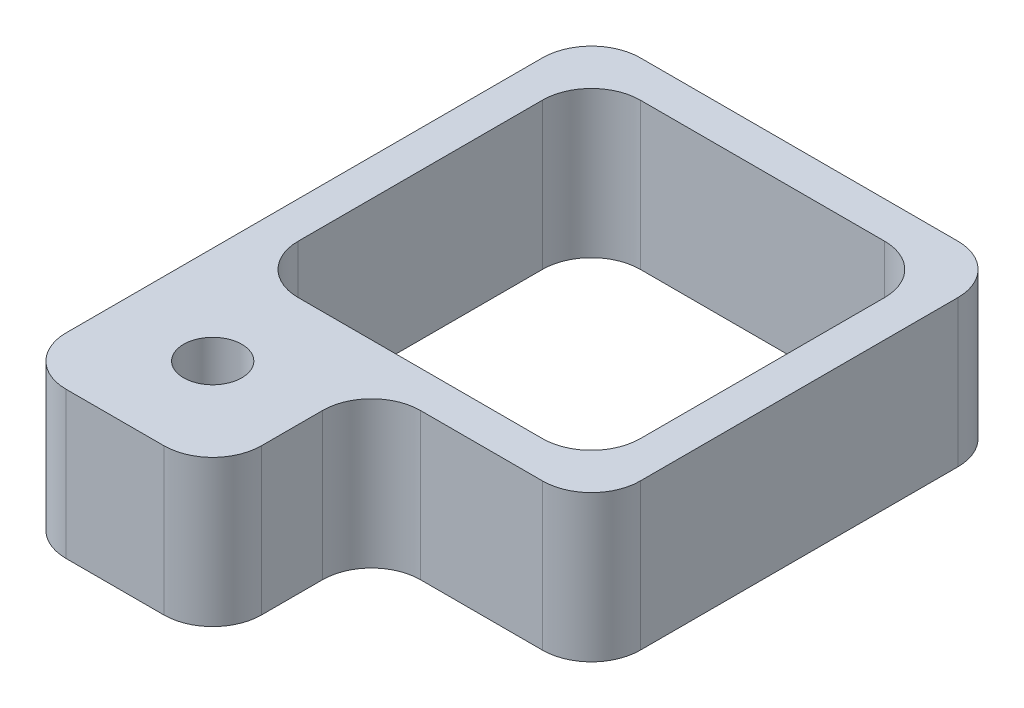
ISO-10303-21;
HEADER;
FILE_DESCRIPTION(('STEP AP214'),'2;1');
FILE_NAME('part.step','',(''),(''),'','','');
FILE_SCHEMA(('AUTOMOTIVE_DESIGN { 1 0 10303 214 1 1 1 1 }'));
ENDSEC;
DATA;
#1=APPLICATION_CONTEXT('core data for automotive mechanical design processes');
#2=APPLICATION_PROTOCOL_DEFINITION('international standard','automotive_design',2000,#1);
#3=PRODUCT_CONTEXT('',#1,'mechanical');
#4=PRODUCT('Part','Part','',(#3));
#5=PRODUCT_RELATED_PRODUCT_CATEGORY('part','',(#4));
#6=PRODUCT_DEFINITION_FORMATION('','',#4);
#7=PRODUCT_DEFINITION_CONTEXT('part definition',#1,'design');
#8=PRODUCT_DEFINITION('design','',#6,#7);
#9=PRODUCT_DEFINITION_SHAPE('','',#8);
#10=(LENGTH_UNIT() NAMED_UNIT(*) SI_UNIT(.MILLI.,.METRE.));
#11=(NAMED_UNIT(*) PLANE_ANGLE_UNIT() SI_UNIT($,.RADIAN.));
#12=(NAMED_UNIT(*) SI_UNIT($,.STERADIAN.) SOLID_ANGLE_UNIT());
#13=UNCERTAINTY_MEASURE_WITH_UNIT(LENGTH_MEASURE(1.E-05),#10,'distance_accuracy_value','');
#14=(GEOMETRIC_REPRESENTATION_CONTEXT(3) GLOBAL_UNCERTAINTY_ASSIGNED_CONTEXT((#13)) GLOBAL_UNIT_ASSIGNED_CONTEXT((#10,
#11,#12)) REPRESENTATION_CONTEXT('',''));
#15=CARTESIAN_POINT('',(0.,0.,0.));
#16=DIRECTION('',(0.,0.,1.));
#17=DIRECTION('',(1.,0.,0.));
#18=AXIS2_PLACEMENT_3D('',#15,#16,#17);
#19=CARTESIAN_POINT('',(-4.25,3.,-4.25));
#20=DIRECTION('',(0.,0.,1.));
#21=DIRECTION('',(1.,0.,0.));
#22=AXIS2_PLACEMENT_3D('',#19,#20,#21);
#23=PLANE('',#22);
#24=DIRECTION('',(-1.,0.,0.));
#25=VECTOR('',#24,1.);
#26=CARTESIAN_POINT('',(-4.25,3.,-4.25));
#27=LINE('',#26,#25);
#28=CARTESIAN_POINT('',(3.25,3.,-4.25));
#29=VERTEX_POINT('',#28);
#30=CARTESIAN_POINT('',(-3.25,3.,-4.25));
#31=VERTEX_POINT('',#30);
#32=EDGE_CURVE('E246',#29,#31,#27,.T.);
#33=ORIENTED_EDGE('',*,*,#32,.F.);
#34=DIRECTION('',(0.,-1.,0.));
#35=VECTOR('',#34,1.);
#36=CARTESIAN_POINT('',(3.25,3.,-4.25));
#37=LINE('',#36,#35);
#38=CARTESIAN_POINT('',(3.25,0.,-4.25));
#39=VERTEX_POINT('',#38);
#40=EDGE_CURVE('E290',#29,#39,#37,.T.);
#41=ORIENTED_EDGE('',*,*,#40,.T.);
#42=DIRECTION('',(-1.,0.,0.));
#43=VECTOR('',#42,1.);
#44=CARTESIAN_POINT('',(-4.25,0.,-4.25));
#45=LINE('',#44,#43);
#46=CARTESIAN_POINT('',(1.42960296038314,0.,-4.25));
#47=VERTEX_POINT('',#46);
#48=EDGE_CURVE('E378',#39,#47,#45,.T.);
#49=ORIENTED_EDGE('',*,*,#48,.T.);
#50=DIRECTION('',(0.,-1.,0.));
#51=VECTOR('',#50,1.);
#52=CARTESIAN_POINT('',(1.42960296038314,1.,-4.25));
#53=LINE('',#52,#51);
#54=CARTESIAN_POINT('',(1.42960296038314,1.,-4.25));
#55=VERTEX_POINT('',#54);
#56=EDGE_CURVE('E211',#55,#47,#53,.T.);
#57=ORIENTED_EDGE('',*,*,#56,.F.);
#58=DIRECTION('',(1.,0.,0.));
#59=VECTOR('',#58,1.);
#60=CARTESIAN_POINT('',(1.42960296038314,1.,-4.25));
#61=LINE('',#60,#59);
#62=CARTESIAN_POINT('',(-0.570397039616865,1.,-4.25));
#63=VERTEX_POINT('',#62);
#64=EDGE_CURVE('E449',#63,#55,#61,.T.);
#65=ORIENTED_EDGE('',*,*,#64,.F.);
#66=DIRECTION('',(0.,1.,0.));
#67=VECTOR('',#66,1.);
#68=CARTESIAN_POINT('',(-0.570397039616865,1.,-4.25));
#69=LINE('',#68,#67);
#70=CARTESIAN_POINT('',(-0.570397039616865,0.,-4.25));
#71=VERTEX_POINT('',#70);
#72=EDGE_CURVE('E214',#71,#63,#69,.T.);
#73=ORIENTED_EDGE('',*,*,#72,.F.);
#74=CARTESIAN_POINT('',(-3.25,0.,-4.25));
#75=VERTEX_POINT('',#74);
#76=EDGE_CURVE('E375',#71,#75,#45,.T.);
#77=ORIENTED_EDGE('',*,*,#76,.T.);
#78=DIRECTION('',(0.,-1.,0.));
#79=VECTOR('',#78,1.);
#80=CARTESIAN_POINT('',(-3.25,3.,-4.25));
#81=LINE('',#80,#79);
#82=EDGE_CURVE('E288',#75,#31,#81,.F.);
#83=ORIENTED_EDGE('',*,*,#82,.T.);
#84=EDGE_LOOP('',(#33,#41,#49,#57,#65,#73,#77,#83));
#85=FACE_BOUND('',#84,.T.);
#86=ADVANCED_FACE('F30',(#85),#23,.F.);
#87=CARTESIAN_POINT('',(-4.25,3.,4.25));
#88=DIRECTION('',(0.,0.,-1.));
#89=DIRECTION('',(-1.,0.,0.));
#90=AXIS2_PLACEMENT_3D('',#87,#88,#89);
#91=PLANE('',#90);
#92=DIRECTION('',(1.,0.,0.));
#93=VECTOR('',#92,1.);
#94=CARTESIAN_POINT('',(-4.25,3.,4.25));
#95=LINE('',#94,#93);
#96=CARTESIAN_POINT('',(0.749999999999998,3.,4.25));
#97=VERTEX_POINT('',#96);
#98=CARTESIAN_POINT('',(3.25,3.,4.25));
#99=VERTEX_POINT('',#98);
#100=EDGE_CURVE('E253',#97,#99,#95,.T.);
#101=ORIENTED_EDGE('',*,*,#100,.F.);
#102=DIRECTION('',(0.,1.,0.));
#103=VECTOR('',#102,1.);
#104=CARTESIAN_POINT('',(0.749999999999998,0.,4.25));
#105=LINE('',#104,#103);
#106=CARTESIAN_POINT('',(0.749999999999998,0.,4.25));
#107=VERTEX_POINT('',#106);
#108=EDGE_CURVE('E281',#97,#107,#105,.F.);
#109=ORIENTED_EDGE('',*,*,#108,.T.);
#110=DIRECTION('',(1.,0.,0.));
#111=VECTOR('',#110,1.);
#112=CARTESIAN_POINT('',(-4.25,0.,4.25));
#113=LINE('',#112,#111);
#114=CARTESIAN_POINT('',(3.25,0.,4.25));
#115=VERTEX_POINT('',#114);
#116=EDGE_CURVE('E247',#107,#115,#113,.T.);
#117=ORIENTED_EDGE('',*,*,#116,.T.);
#118=DIRECTION('',(0.,-1.,0.));
#119=VECTOR('',#118,1.);
#120=CARTESIAN_POINT('',(3.25,3.,4.25));
#121=LINE('',#120,#119);
#122=EDGE_CURVE('E45',#115,#99,#121,.F.);
#123=ORIENTED_EDGE('',*,*,#122,.T.);
#124=EDGE_LOOP('',(#101,#109,#117,#123));
#125=FACE_BOUND('',#124,.T.);
#126=ADVANCED_FACE('F467',(#125),#91,.F.);
#127=CARTESIAN_POINT('',(4.25,3.,4.25));
#128=DIRECTION('',(-1.,0.,0.));
#129=DIRECTION('',(0.,0.,1.));
#130=AXIS2_PLACEMENT_3D('',#127,#128,#129);
#131=PLANE('',#130);
#132=DIRECTION('',(0.,0.,-1.));
#133=VECTOR('',#132,1.);
#134=CARTESIAN_POINT('',(4.25,3.,4.25));
#135=LINE('',#134,#133);
#136=CARTESIAN_POINT('',(4.25,3.,3.25));
#137=VERTEX_POINT('',#136);
#138=CARTESIAN_POINT('',(4.25,3.,-3.25));
#139=VERTEX_POINT('',#138);
#140=EDGE_CURVE('E243',#137,#139,#135,.T.);
#141=ORIENTED_EDGE('',*,*,#140,.F.);
#142=DIRECTION('',(0.,-1.,0.));
#143=VECTOR('',#142,1.);
#144=CARTESIAN_POINT('',(4.25,3.,3.25));
#145=LINE('',#144,#143);
#146=CARTESIAN_POINT('',(4.25,0.,3.25));
#147=VERTEX_POINT('',#146);
#148=EDGE_CURVE('E285',#137,#147,#145,.T.);
#149=ORIENTED_EDGE('',*,*,#148,.T.);
#150=DIRECTION('',(0.,0.,-1.));
#151=VECTOR('',#150,1.);
#152=CARTESIAN_POINT('',(4.25,0.,4.25));
#153=LINE('',#152,#151);
#154=CARTESIAN_POINT('',(4.25,0.,-3.25));
#155=VERTEX_POINT('',#154);
#156=EDGE_CURVE('E256',#147,#155,#153,.T.);
#157=ORIENTED_EDGE('',*,*,#156,.T.);
#158=DIRECTION('',(0.,-1.,0.));
#159=VECTOR('',#158,1.);
#160=CARTESIAN_POINT('',(4.25,3.,-3.25));
#161=LINE('',#160,#159);
#162=EDGE_CURVE('E283',#155,#139,#161,.F.);
#163=ORIENTED_EDGE('',*,*,#162,.T.);
#164=EDGE_LOOP('',(#141,#149,#157,#163));
#165=FACE_BOUND('',#164,.T.);
#166=ADVANCED_FACE('F427',(#165),#131,.F.);
#167=CARTESIAN_POINT('',(-4.25,3.,4.25));
#168=DIRECTION('',(1.,0.,0.));
#169=DIRECTION('',(0.,0.,-1.));
#170=AXIS2_PLACEMENT_3D('',#167,#168,#169);
#171=PLANE('',#170);
#172=DIRECTION('',(0.,0.,1.));
#173=VECTOR('',#172,1.);
#174=CARTESIAN_POINT('',(-4.25,0.,4.25));
#175=LINE('',#174,#173);
#176=CARTESIAN_POINT('',(-4.25,0.,-3.25));
#177=VERTEX_POINT('',#176);
#178=CARTESIAN_POINT('',(-4.25,0.,6.5));
#179=VERTEX_POINT('',#178);
#180=EDGE_CURVE('E358',#177,#179,#175,.T.);
#181=ORIENTED_EDGE('',*,*,#180,.T.);
#182=DIRECTION('',(0.,-1.,0.));
#183=VECTOR('',#182,1.);
#184=CARTESIAN_POINT('',(-4.25,3.,6.5));
#185=LINE('',#184,#183);
#186=CARTESIAN_POINT('',(-4.25,3.,6.5));
#187=VERTEX_POINT('',#186);
#188=EDGE_CURVE('E267',#179,#187,#185,.F.);
#189=ORIENTED_EDGE('',*,*,#188,.T.);
#190=DIRECTION('',(0.,0.,1.));
#191=VECTOR('',#190,1.);
#192=CARTESIAN_POINT('',(-4.25,3.,4.25));
#193=LINE('',#192,#191);
#194=CARTESIAN_POINT('',(-4.25,3.,-3.25));
#195=VERTEX_POINT('',#194);
#196=EDGE_CURVE('E250',#195,#187,#193,.T.);
#197=ORIENTED_EDGE('',*,*,#196,.F.);
#198=DIRECTION('',(0.,-1.,0.));
#199=VECTOR('',#198,1.);
#200=CARTESIAN_POINT('',(-4.25,3.,-3.25));
#201=LINE('',#200,#199);
#202=EDGE_CURVE('E392',#195,#177,#201,.T.);
#203=ORIENTED_EDGE('',*,*,#202,.T.);
#204=EDGE_LOOP('',(#181,#189,#197,#203));
#205=FACE_BOUND('',#204,.T.);
#206=ADVANCED_FACE('F398',(#205),#171,.F.);
#207=CARTESIAN_POINT('',(4.25,3.,-4.25));
#208=DIRECTION('',(0.,-1.,0.));
#209=DIRECTION('',(0.,0.,-1.));
#210=AXIS2_PLACEMENT_3D('',#207,#208,#209);
#211=PLANE('',#210);
#212=CARTESIAN_POINT('',(-2.25,3.,5.5));
#213=DIRECTION('',(0.,1.,0.));
#214=DIRECTION('',(0.,0.,1.));
#215=AXIS2_PLACEMENT_3D('',#212,#213,#214);
#216=CIRCLE('',#215,0.595629999999988);
#217=CARTESIAN_POINT('',(-2.25,3.,6.09562999999999));
#218=VERTEX_POINT('',#217);
#219=EDGE_CURVE('E215',#218,#218,#216,.T.);
#220=ORIENTED_EDGE('',*,*,#219,.F.);
#221=EDGE_LOOP('',(#220));
#222=FACE_BOUND('',#221,.T.);
#223=DIRECTION('',(-1.,0.,0.));
#224=VECTOR('',#223,1.);
#225=CARTESIAN_POINT('',(-3.5,3.,-3.5));
#226=LINE('',#225,#224);
#227=CARTESIAN_POINT('',(2.5,3.,-3.5));
#228=VERTEX_POINT('',#227);
#229=CARTESIAN_POINT('',(-2.5,3.,-3.5));
#230=VERTEX_POINT('',#229);
#231=EDGE_CURVE('E227',#228,#230,#226,.T.);
#232=ORIENTED_EDGE('',*,*,#231,.F.);
#233=CARTESIAN_POINT('',(2.5,3.,-2.5));
#234=DIRECTION('',(0.,-1.,0.));
#235=DIRECTION('',(0.,0.,-1.));
#236=AXIS2_PLACEMENT_3D('',#233,#234,#235);
#237=CIRCLE('',#236,1.);
#238=CARTESIAN_POINT('',(3.5,3.,-2.5));
#239=VERTEX_POINT('',#238);
#240=EDGE_CURVE('E293',#228,#239,#237,.T.);
#241=ORIENTED_EDGE('',*,*,#240,.T.);
#242=DIRECTION('',(0.,0.,-1.));
#243=VECTOR('',#242,1.);
#244=CARTESIAN_POINT('',(3.5,3.,3.5));
#245=LINE('',#244,#243);
#246=CARTESIAN_POINT('',(3.5,3.,2.5));
#247=VERTEX_POINT('',#246);
#248=EDGE_CURVE('E224',#247,#239,#245,.T.);
#249=ORIENTED_EDGE('',*,*,#248,.F.);
#250=CARTESIAN_POINT('',(2.5,3.,2.5));
#251=DIRECTION('',(0.,-1.,0.));
#252=DIRECTION('',(0.,0.,-1.));
#253=AXIS2_PLACEMENT_3D('',#250,#251,#252);
#254=CIRCLE('',#253,1.);
#255=CARTESIAN_POINT('',(2.5,3.,3.5));
#256=VERTEX_POINT('',#255);
#257=EDGE_CURVE('E305',#247,#256,#254,.T.);
#258=ORIENTED_EDGE('',*,*,#257,.T.);
#259=DIRECTION('',(1.,0.,0.));
#260=VECTOR('',#259,1.);
#261=CARTESIAN_POINT('',(-3.5,3.,3.5));
#262=LINE('',#261,#260);
#263=CARTESIAN_POINT('',(-2.5,3.,3.5));
#264=VERTEX_POINT('',#263);
#265=EDGE_CURVE('E233',#264,#256,#262,.T.);
#266=ORIENTED_EDGE('',*,*,#265,.F.);
#267=CARTESIAN_POINT('',(-2.5,3.,2.5));
#268=DIRECTION('',(0.,-1.,0.));
#269=DIRECTION('',(0.,0.,-1.));
#270=AXIS2_PLACEMENT_3D('',#267,#268,#269);
#271=CIRCLE('',#270,1.);
#272=CARTESIAN_POINT('',(-3.5,3.,2.5));
#273=VERTEX_POINT('',#272);
#274=EDGE_CURVE('E301',#264,#273,#271,.T.);
#275=ORIENTED_EDGE('',*,*,#274,.T.);
#276=DIRECTION('',(0.,0.,1.));
#277=VECTOR('',#276,1.);
#278=CARTESIAN_POINT('',(-3.5,3.,3.5));
#279=LINE('',#278,#277);
#280=CARTESIAN_POINT('',(-3.5,3.,-2.5));
#281=VERTEX_POINT('',#280);
#282=EDGE_CURVE('E230',#281,#273,#279,.T.);
#283=ORIENTED_EDGE('',*,*,#282,.F.);
#284=CARTESIAN_POINT('',(-2.5,3.,-2.5));
#285=DIRECTION('',(0.,-1.,0.));
#286=DIRECTION('',(0.,0.,-1.));
#287=AXIS2_PLACEMENT_3D('',#284,#285,#286);
#288=CIRCLE('',#287,1.);
#289=EDGE_CURVE('E297',#281,#230,#288,.T.);
#290=ORIENTED_EDGE('',*,*,#289,.T.);
#291=EDGE_LOOP('',(#232,#241,#249,#258,#266,#275,#283,#290));
#292=FACE_BOUND('',#291,.T.);
#293=ORIENTED_EDGE('',*,*,#196,.T.);
#294=CARTESIAN_POINT('',(-3.25,3.,6.5));
#295=DIRECTION('',(0.,-1.,0.));
#296=DIRECTION('',(0.,0.,-1.));
#297=AXIS2_PLACEMENT_3D('',#294,#295,#296);
#298=CIRCLE('',#297,1.);
#299=CARTESIAN_POINT('',(-3.25,3.,7.5));
#300=VERTEX_POINT('',#299);
#301=EDGE_CURVE('E273',#187,#300,#298,.F.);
#302=ORIENTED_EDGE('',*,*,#301,.T.);
#303=DIRECTION('',(-1.,0.,0.));
#304=VECTOR('',#303,1.);
#305=CARTESIAN_POINT('',(-4.25,3.,7.5));
#306=LINE('',#305,#304);
#307=CARTESIAN_POINT('',(-1.25,3.,7.5));
#308=VERTEX_POINT('',#307);
#309=EDGE_CURVE('E239',#308,#300,#306,.T.);
#310=ORIENTED_EDGE('',*,*,#309,.F.);
#311=CARTESIAN_POINT('',(-1.25,3.,6.5));
#312=DIRECTION('',(0.,-1.,0.));
#313=DIRECTION('',(0.,0.,-1.));
#314=AXIS2_PLACEMENT_3D('',#311,#312,#313);
#315=CIRCLE('',#314,1.);
#316=CARTESIAN_POINT('',(-0.250000000000002,3.,6.5));
#317=VERTEX_POINT('',#316);
#318=EDGE_CURVE('E271',#308,#317,#315,.F.);
#319=ORIENTED_EDGE('',*,*,#318,.T.);
#320=DIRECTION('',(0.,0.,-1.));
#321=VECTOR('',#320,1.);
#322=CARTESIAN_POINT('',(-0.250000000000002,3.,7.5));
#323=LINE('',#322,#321);
#324=CARTESIAN_POINT('',(-0.250000000000002,3.,5.25));
#325=VERTEX_POINT('',#324);
#326=EDGE_CURVE('E242',#317,#325,#323,.T.);
#327=ORIENTED_EDGE('',*,*,#326,.T.);
#328=CARTESIAN_POINT('',(0.749999999999998,3.,5.25));
#329=DIRECTION('',(0.,-1.,0.));
#330=DIRECTION('',(0.,0.,-1.));
#331=AXIS2_PLACEMENT_3D('',#328,#329,#330);
#332=CIRCLE('',#331,1.);
#333=EDGE_CURVE('E38',#325,#97,#332,.T.);
#334=ORIENTED_EDGE('',*,*,#333,.T.);
#335=ORIENTED_EDGE('',*,*,#100,.T.);
#336=CARTESIAN_POINT('',(3.25,3.,3.25));
#337=DIRECTION('',(0.,-1.,0.));
#338=DIRECTION('',(0.,0.,-1.));
#339=AXIS2_PLACEMENT_3D('',#336,#337,#338);
#340=CIRCLE('',#339,1.);
#341=EDGE_CURVE('E269',#99,#137,#340,.F.);
#342=ORIENTED_EDGE('',*,*,#341,.T.);
#343=ORIENTED_EDGE('',*,*,#140,.T.);
#344=CARTESIAN_POINT('',(3.25,3.,-3.25));
#345=DIRECTION('',(0.,-1.,0.));
#346=DIRECTION('',(0.,0.,-1.));
#347=AXIS2_PLACEMENT_3D('',#344,#345,#346);
#348=CIRCLE('',#347,1.);
#349=EDGE_CURVE('E266',#139,#29,#348,.F.);
#350=ORIENTED_EDGE('',*,*,#349,.T.);
#351=ORIENTED_EDGE('',*,*,#32,.T.);
#352=CARTESIAN_POINT('',(-3.25,3.,-3.25));
#353=DIRECTION('',(0.,-1.,0.));
#354=DIRECTION('',(0.,0.,-1.));
#355=AXIS2_PLACEMENT_3D('',#352,#353,#354);
#356=CIRCLE('',#355,1.);
#357=EDGE_CURVE('E264',#31,#195,#356,.F.);
#358=ORIENTED_EDGE('',*,*,#357,.T.);
#359=EDGE_LOOP('',(#293,#302,#310,#319,#327,#334,#335,#342,#343,#350,#351,#358));
#360=FACE_BOUND('',#359,.T.);
#361=ADVANCED_FACE('F403',(#222,#292,#360),#211,.F.);
#362=CARTESIAN_POINT('',(4.25,0.,-4.25));
#363=DIRECTION('',(0.,-1.,0.));
#364=DIRECTION('',(0.,0.,-1.));
#365=AXIS2_PLACEMENT_3D('',#362,#363,#364);
#366=PLANE('',#365);
#367=CARTESIAN_POINT('',(-2.25,0.,5.5));
#368=DIRECTION('',(0.,-1.,0.));
#369=DIRECTION('',(0.,0.,-1.));
#370=AXIS2_PLACEMENT_3D('',#367,#368,#369);
#371=CIRCLE('',#370,0.595629999999993);
#372=CARTESIAN_POINT('',(-2.25,0.,4.90437000000001));
#373=VERTEX_POINT('',#372);
#374=EDGE_CURVE('E218',#373,#373,#371,.T.);
#375=ORIENTED_EDGE('',*,*,#374,.F.);
#376=EDGE_LOOP('',(#375));
#377=FACE_BOUND('',#376,.T.);
#378=DIRECTION('',(0.,0.,1.));
#379=VECTOR('',#378,1.);
#380=CARTESIAN_POINT('',(3.5,0.,-4.25));
#381=LINE('',#380,#379);
#382=CARTESIAN_POINT('',(3.5,0.,-2.5));
#383=VERTEX_POINT('',#382);
#384=CARTESIAN_POINT('',(3.5,0.,2.5));
#385=VERTEX_POINT('',#384);
#386=EDGE_CURVE('E315',#383,#385,#381,.T.);
#387=ORIENTED_EDGE('',*,*,#386,.F.);
#388=CARTESIAN_POINT('',(2.5,0.,-2.5));
#389=DIRECTION('',(0.,-1.,0.));
#390=DIRECTION('',(0.,0.,-1.));
#391=AXIS2_PLACEMENT_3D('',#388,#389,#390);
#392=CIRCLE('',#391,1.);
#393=CARTESIAN_POINT('',(2.5,0.,-3.5));
#394=VERTEX_POINT('',#393);
#395=EDGE_CURVE('E295',#383,#394,#392,.F.);
#396=ORIENTED_EDGE('',*,*,#395,.T.);
#397=DIRECTION('',(1.,0.,0.));
#398=VECTOR('',#397,1.);
#399=CARTESIAN_POINT('',(4.25,0.,-3.5));
#400=LINE('',#399,#398);
#401=CARTESIAN_POINT('',(-2.5,0.,-3.5));
#402=VERTEX_POINT('',#401);
#403=EDGE_CURVE('E261',#402,#394,#400,.T.);
#404=ORIENTED_EDGE('',*,*,#403,.F.);
#405=CARTESIAN_POINT('',(-2.5,0.,-2.5));
#406=DIRECTION('',(0.,-1.,0.));
#407=DIRECTION('',(0.,0.,-1.));
#408=AXIS2_PLACEMENT_3D('',#405,#406,#407);
#409=CIRCLE('',#408,1.);
#410=CARTESIAN_POINT('',(-3.5,0.,-2.5));
#411=VERTEX_POINT('',#410);
#412=EDGE_CURVE('E299',#402,#411,#409,.F.);
#413=ORIENTED_EDGE('',*,*,#412,.T.);
#414=DIRECTION('',(0.,0.,-1.));
#415=VECTOR('',#414,1.);
#416=CARTESIAN_POINT('',(-3.5,0.,-4.25));
#417=LINE('',#416,#415);
#418=CARTESIAN_POINT('',(-3.5,0.,2.5));
#419=VERTEX_POINT('',#418);
#420=EDGE_CURVE('E369',#419,#411,#417,.T.);
#421=ORIENTED_EDGE('',*,*,#420,.F.);
#422=CARTESIAN_POINT('',(-2.5,0.,2.5));
#423=DIRECTION('',(0.,-1.,0.));
#424=DIRECTION('',(0.,0.,-1.));
#425=AXIS2_PLACEMENT_3D('',#422,#423,#424);
#426=CIRCLE('',#425,1.);
#427=CARTESIAN_POINT('',(-2.5,0.,3.5));
#428=VERTEX_POINT('',#427);
#429=EDGE_CURVE('E303',#419,#428,#426,.F.);
#430=ORIENTED_EDGE('',*,*,#429,.T.);
#431=DIRECTION('',(-1.,0.,0.));
#432=VECTOR('',#431,1.);
#433=CARTESIAN_POINT('',(4.25,0.,3.5));
#434=LINE('',#433,#432);
#435=CARTESIAN_POINT('',(2.5,0.,3.5));
#436=VERTEX_POINT('',#435);
#437=EDGE_CURVE('E318',#436,#428,#434,.T.);
#438=ORIENTED_EDGE('',*,*,#437,.F.);
#439=CARTESIAN_POINT('',(2.5,0.,2.5));
#440=DIRECTION('',(0.,-1.,0.));
#441=DIRECTION('',(0.,0.,-1.));
#442=AXIS2_PLACEMENT_3D('',#439,#440,#441);
#443=CIRCLE('',#442,1.);
#444=EDGE_CURVE('E307',#436,#385,#443,.F.);
#445=ORIENTED_EDGE('',*,*,#444,.T.);
#446=EDGE_LOOP('',(#387,#396,#404,#413,#421,#430,#438,#445));
#447=FACE_BOUND('',#446,.T.);
#448=DIRECTION('',(1.,0.,0.));
#449=VECTOR('',#448,1.);
#450=CARTESIAN_POINT('',(-4.25,0.,7.5));
#451=LINE('',#450,#449);
#452=CARTESIAN_POINT('',(-3.25,0.,7.5));
#453=VERTEX_POINT('',#452);
#454=CARTESIAN_POINT('',(-1.25,0.,7.5));
#455=VERTEX_POINT('',#454);
#456=EDGE_CURVE('E236',#453,#455,#451,.T.);
#457=ORIENTED_EDGE('',*,*,#456,.F.);
#458=CARTESIAN_POINT('',(-3.25,0.,6.5));
#459=DIRECTION('',(0.,-1.,0.));
#460=DIRECTION('',(0.,0.,-1.));
#461=AXIS2_PLACEMENT_3D('',#458,#459,#460);
#462=CIRCLE('',#461,1.);
#463=EDGE_CURVE('E390',#453,#179,#462,.T.);
#464=ORIENTED_EDGE('',*,*,#463,.T.);
#465=ORIENTED_EDGE('',*,*,#180,.F.);
#466=CARTESIAN_POINT('',(-3.25,0.,-3.25));
#467=DIRECTION('',(0.,-1.,0.));
#468=DIRECTION('',(0.,0.,-1.));
#469=AXIS2_PLACEMENT_3D('',#466,#467,#468);
#470=CIRCLE('',#469,1.);
#471=EDGE_CURVE('E355',#177,#75,#470,.T.);
#472=ORIENTED_EDGE('',*,*,#471,.T.);
#473=ORIENTED_EDGE('',*,*,#76,.F.);
#474=DIRECTION('',(0.,0.,1.));
#475=VECTOR('',#474,1.);
#476=CARTESIAN_POINT('',(-0.570397039616865,0.,-5.75));
#477=LINE('',#476,#475);
#478=CARTESIAN_POINT('',(-0.570397039616865,0.,-5.75));
#479=VERTEX_POINT('',#478);
#480=EDGE_CURVE('E439',#479,#71,#477,.T.);
#481=ORIENTED_EDGE('',*,*,#480,.F.);
#482=DIRECTION('',(-1.,0.,0.));
#483=VECTOR('',#482,1.);
#484=CARTESIAN_POINT('',(1.42960296038314,0.,-5.75));
#485=LINE('',#484,#483);
#486=CARTESIAN_POINT('',(1.42960296038314,0.,-5.75));
#487=VERTEX_POINT('',#486);
#488=EDGE_CURVE('E207',#487,#479,#485,.T.);
#489=ORIENTED_EDGE('',*,*,#488,.F.);
#490=DIRECTION('',(0.,0.,1.));
#491=VECTOR('',#490,1.);
#492=CARTESIAN_POINT('',(1.42960296038314,0.,-5.75));
#493=LINE('',#492,#491);
#494=EDGE_CURVE('E220',#487,#47,#493,.T.);
#495=ORIENTED_EDGE('',*,*,#494,.T.);
#496=ORIENTED_EDGE('',*,*,#48,.F.);
#497=CARTESIAN_POINT('',(3.25,0.,-3.25));
#498=DIRECTION('',(0.,-1.,0.));
#499=DIRECTION('',(0.,0.,-1.));
#500=AXIS2_PLACEMENT_3D('',#497,#498,#499);
#501=CIRCLE('',#500,1.);
#502=EDGE_CURVE('E384',#39,#155,#501,.T.);
#503=ORIENTED_EDGE('',*,*,#502,.T.);
#504=ORIENTED_EDGE('',*,*,#156,.F.);
#505=CARTESIAN_POINT('',(3.25,0.,3.25));
#506=DIRECTION('',(0.,-1.,0.));
#507=DIRECTION('',(0.,0.,-1.));
#508=AXIS2_PLACEMENT_3D('',#505,#506,#507);
#509=CIRCLE('',#508,1.);
#510=EDGE_CURVE('E386',#147,#115,#509,.T.);
#511=ORIENTED_EDGE('',*,*,#510,.T.);
#512=ORIENTED_EDGE('',*,*,#116,.F.);
#513=CARTESIAN_POINT('',(0.749999999999998,0.,5.25));
#514=DIRECTION('',(0.,-1.,0.));
#515=DIRECTION('',(0.,0.,-1.));
#516=AXIS2_PLACEMENT_3D('',#513,#514,#515);
#517=CIRCLE('',#516,1.);
#518=CARTESIAN_POINT('',(-0.250000000000002,0.,5.25));
#519=VERTEX_POINT('',#518);
#520=EDGE_CURVE('E11',#107,#519,#517,.F.);
#521=ORIENTED_EDGE('',*,*,#520,.T.);
#522=DIRECTION('',(0.,0.,-1.));
#523=VECTOR('',#522,1.);
#524=CARTESIAN_POINT('',(-0.250000000000002,0.,7.5));
#525=LINE('',#524,#523);
#526=CARTESIAN_POINT('',(-0.250000000000002,0.,6.5));
#527=VERTEX_POINT('',#526);
#528=EDGE_CURVE('E359',#527,#519,#525,.T.);
#529=ORIENTED_EDGE('',*,*,#528,.F.);
#530=CARTESIAN_POINT('',(-1.25,0.,6.5));
#531=DIRECTION('',(0.,-1.,0.));
#532=DIRECTION('',(0.,0.,-1.));
#533=AXIS2_PLACEMENT_3D('',#530,#531,#532);
#534=CIRCLE('',#533,1.);
#535=EDGE_CURVE('E388',#527,#455,#534,.T.);
#536=ORIENTED_EDGE('',*,*,#535,.T.);
#537=EDGE_LOOP('',(#457,#464,#465,#472,#473,#481,#489,#495,#496,#503,#504,#511,#512,#521,#529,#536));
#538=FACE_BOUND('',#537,.T.);
#539=ADVANCED_FACE('F313',(#377,#447,#538),#366,.T.);
#540=CARTESIAN_POINT('',(-0.250000000000002,3.,7.5));
#541=DIRECTION('',(-1.,0.,0.));
#542=DIRECTION('',(0.,0.,1.));
#543=AXIS2_PLACEMENT_3D('',#540,#541,#542);
#544=PLANE('',#543);
#545=ORIENTED_EDGE('',*,*,#326,.F.);
#546=DIRECTION('',(0.,1.,0.));
#547=VECTOR('',#546,1.);
#548=CARTESIAN_POINT('',(-0.250000000000002,0.,6.5));
#549=LINE('',#548,#547);
#550=EDGE_CURVE('E278',#317,#527,#549,.F.);
#551=ORIENTED_EDGE('',*,*,#550,.T.);
#552=ORIENTED_EDGE('',*,*,#528,.T.);
#553=DIRECTION('',(0.,1.,0.));
#554=VECTOR('',#553,1.);
#555=CARTESIAN_POINT('',(-0.250000000000002,3.,5.25));
#556=LINE('',#555,#554);
#557=EDGE_CURVE('E275',#519,#325,#556,.T.);
#558=ORIENTED_EDGE('',*,*,#557,.T.);
#559=EDGE_LOOP('',(#545,#551,#552,#558));
#560=FACE_BOUND('',#559,.T.);
#561=ADVANCED_FACE('F420',(#560),#544,.F.);
#562=CARTESIAN_POINT('',(-4.25,0.,7.5));
#563=DIRECTION('',(0.,0.,1.));
#564=DIRECTION('',(1.,0.,0.));
#565=AXIS2_PLACEMENT_3D('',#562,#563,#564);
#566=PLANE('',#565);
#567=ORIENTED_EDGE('',*,*,#309,.T.);
#568=DIRECTION('',(0.,-1.,0.));
#569=VECTOR('',#568,1.);
#570=CARTESIAN_POINT('',(-3.25,0.,7.5));
#571=LINE('',#570,#569);
#572=EDGE_CURVE('E352',#300,#453,#571,.T.);
#573=ORIENTED_EDGE('',*,*,#572,.T.);
#574=ORIENTED_EDGE('',*,*,#456,.T.);
#575=DIRECTION('',(0.,1.,0.));
#576=VECTOR('',#575,1.);
#577=CARTESIAN_POINT('',(-1.25,3.,7.5));
#578=LINE('',#577,#576);
#579=EDGE_CURVE('E349',#455,#308,#578,.T.);
#580=ORIENTED_EDGE('',*,*,#579,.T.);
#581=EDGE_LOOP('',(#567,#573,#574,#580));
#582=FACE_BOUND('',#581,.T.);
#583=ADVANCED_FACE('F410',(#582),#566,.T.);
#584=CARTESIAN_POINT('',(3.5,-5.00000000001367E-05,3.5));
#585=DIRECTION('',(1.,0.,0.));
#586=DIRECTION('',(0.,0.,-1.));
#587=AXIS2_PLACEMENT_3D('',#584,#585,#586);
#588=PLANE('',#587);
#589=ORIENTED_EDGE('',*,*,#248,.T.);
#590=DIRECTION('',(0.,1.,0.));
#591=VECTOR('',#590,1.);
#592=CARTESIAN_POINT('',(3.5,0.,-2.5));
#593=LINE('',#592,#591);
#594=EDGE_CURVE('E328',#239,#383,#593,.F.);
#595=ORIENTED_EDGE('',*,*,#594,.T.);
#596=ORIENTED_EDGE('',*,*,#386,.T.);
#597=DIRECTION('',(0.,1.,0.));
#598=VECTOR('',#597,1.);
#599=CARTESIAN_POINT('',(3.5,3.,2.5));
#600=LINE('',#599,#598);
#601=EDGE_CURVE('E325',#385,#247,#600,.T.);
#602=ORIENTED_EDGE('',*,*,#601,.T.);
#603=EDGE_LOOP('',(#589,#595,#596,#602));
#604=FACE_BOUND('',#603,.T.);
#605=ADVANCED_FACE('F324',(#604),#588,.F.);
#606=CARTESIAN_POINT('',(-3.5,-5.00000000001367E-05,3.5));
#607=DIRECTION('',(0.,0.,1.));
#608=DIRECTION('',(1.,0.,0.));
#609=AXIS2_PLACEMENT_3D('',#606,#607,#608);
#610=PLANE('',#609);
#611=ORIENTED_EDGE('',*,*,#437,.T.);
#612=DIRECTION('',(0.,1.,0.));
#613=VECTOR('',#612,1.);
#614=CARTESIAN_POINT('',(-2.5,3.,3.5));
#615=LINE('',#614,#613);
#616=EDGE_CURVE('E346',#428,#264,#615,.T.);
#617=ORIENTED_EDGE('',*,*,#616,.T.);
#618=ORIENTED_EDGE('',*,*,#265,.T.);
#619=DIRECTION('',(0.,1.,0.));
#620=VECTOR('',#619,1.);
#621=CARTESIAN_POINT('',(2.5,0.,3.5));
#622=LINE('',#621,#620);
#623=EDGE_CURVE('E344',#256,#436,#622,.F.);
#624=ORIENTED_EDGE('',*,*,#623,.T.);
#625=EDGE_LOOP('',(#611,#617,#618,#624));
#626=FACE_BOUND('',#625,.T.);
#627=ADVANCED_FACE('F580',(#626),#610,.F.);
#628=CARTESIAN_POINT('',(-3.5,-5.00000000001367E-05,3.5));
#629=DIRECTION('',(-1.,0.,0.));
#630=DIRECTION('',(0.,0.,1.));
#631=AXIS2_PLACEMENT_3D('',#628,#629,#630);
#632=PLANE('',#631);
#633=ORIENTED_EDGE('',*,*,#420,.T.);
#634=DIRECTION('',(0.,1.,0.));
#635=VECTOR('',#634,1.);
#636=CARTESIAN_POINT('',(-3.5,3.,-2.5));
#637=LINE('',#636,#635);
#638=EDGE_CURVE('E341',#411,#281,#637,.T.);
#639=ORIENTED_EDGE('',*,*,#638,.T.);
#640=ORIENTED_EDGE('',*,*,#282,.T.);
#641=DIRECTION('',(0.,1.,0.));
#642=VECTOR('',#641,1.);
#643=CARTESIAN_POINT('',(-3.5,0.,2.5));
#644=LINE('',#643,#642);
#645=EDGE_CURVE('E334',#273,#419,#644,.F.);
#646=ORIENTED_EDGE('',*,*,#645,.T.);
#647=EDGE_LOOP('',(#633,#639,#640,#646));
#648=FACE_BOUND('',#647,.T.);
#649=ADVANCED_FACE('F571',(#648),#632,.F.);
#650=CARTESIAN_POINT('',(-3.5,-5.00000000001367E-05,-3.5));
#651=DIRECTION('',(0.,0.,-1.));
#652=DIRECTION('',(-1.,0.,0.));
#653=AXIS2_PLACEMENT_3D('',#650,#651,#652);
#654=PLANE('',#653);
#655=ORIENTED_EDGE('',*,*,#403,.T.);
#656=DIRECTION('',(0.,1.,0.));
#657=VECTOR('',#656,1.);
#658=CARTESIAN_POINT('',(2.5,3.,-3.5));
#659=LINE('',#658,#657);
#660=EDGE_CURVE('E332',#394,#228,#659,.T.);
#661=ORIENTED_EDGE('',*,*,#660,.T.);
#662=ORIENTED_EDGE('',*,*,#231,.T.);
#663=DIRECTION('',(0.,1.,0.));
#664=VECTOR('',#663,1.);
#665=CARTESIAN_POINT('',(-2.5,0.,-3.5));
#666=LINE('',#665,#664);
#667=EDGE_CURVE('E329',#230,#402,#666,.F.);
#668=ORIENTED_EDGE('',*,*,#667,.T.);
#669=EDGE_LOOP('',(#655,#661,#662,#668));
#670=FACE_BOUND('',#669,.T.);
#671=ADVANCED_FACE('F566',(#670),#654,.F.);
#672=CARTESIAN_POINT('',(-2.25,3.,5.5));
#673=DIRECTION('',(0.,1.,0.));
#674=DIRECTION('',(0.,0.,1.));
#675=AXIS2_PLACEMENT_3D('',#672,#673,#674);
#676=CYLINDRICAL_SURFACE('',#675,0.595629999999993);
#677=ORIENTED_EDGE('',*,*,#374,.T.);
#678=EDGE_LOOP('',(#677));
#679=FACE_BOUND('',#678,.T.);
#680=ORIENTED_EDGE('',*,*,#219,.T.);
#681=EDGE_LOOP('',(#680));
#682=FACE_BOUND('',#681,.T.);
#683=ADVANCED_FACE('F570',(#679,#682),#676,.F.);
#684=CARTESIAN_POINT('',(-0.570397039616865,1.,-5.75));
#685=DIRECTION('',(1.,0.,0.));
#686=DIRECTION('',(0.,1.,0.));
#687=AXIS2_PLACEMENT_3D('',#684,#685,#686);
#688=PLANE('',#687);
#689=ORIENTED_EDGE('',*,*,#72,.T.);
#690=DIRECTION('',(0.,0.,1.));
#691=VECTOR('',#690,1.);
#692=CARTESIAN_POINT('',(-0.570397039616865,1.,-5.75));
#693=LINE('',#692,#691);
#694=CARTESIAN_POINT('',(-0.570397039616865,1.,-5.75));
#695=VERTEX_POINT('',#694);
#696=EDGE_CURVE('E195',#695,#63,#693,.T.);
#697=ORIENTED_EDGE('',*,*,#696,.F.);
#698=DIRECTION('',(0.,1.,0.));
#699=VECTOR('',#698,1.);
#700=CARTESIAN_POINT('',(-0.570397039616865,1.,-5.75));
#701=LINE('',#700,#699);
#702=EDGE_CURVE('E202',#479,#695,#701,.T.);
#703=ORIENTED_EDGE('',*,*,#702,.F.);
#704=ORIENTED_EDGE('',*,*,#480,.T.);
#705=EDGE_LOOP('',(#689,#697,#703,#704));
#706=FACE_BOUND('',#705,.T.);
#707=ADVANCED_FACE('F213',(#706),#688,.F.);
#708=CARTESIAN_POINT('',(1.42960296038314,1.,-5.75));
#709=DIRECTION('',(0.,-1.,0.));
#710=DIRECTION('',(0.,0.,-1.));
#711=AXIS2_PLACEMENT_3D('',#708,#709,#710);
#712=PLANE('',#711);
#713=ORIENTED_EDGE('',*,*,#64,.T.);
#714=DIRECTION('',(0.,0.,1.));
#715=VECTOR('',#714,1.);
#716=CARTESIAN_POINT('',(1.42960296038314,1.,-5.75));
#717=LINE('',#716,#715);
#718=CARTESIAN_POINT('',(1.42960296038314,1.,-5.75));
#719=VERTEX_POINT('',#718);
#720=EDGE_CURVE('E198',#719,#55,#717,.T.);
#721=ORIENTED_EDGE('',*,*,#720,.F.);
#722=DIRECTION('',(1.,0.,0.));
#723=VECTOR('',#722,1.);
#724=CARTESIAN_POINT('',(1.42960296038314,1.,-5.75));
#725=LINE('',#724,#723);
#726=EDGE_CURVE('E190',#695,#719,#725,.T.);
#727=ORIENTED_EDGE('',*,*,#726,.F.);
#728=ORIENTED_EDGE('',*,*,#696,.T.);
#729=EDGE_LOOP('',(#713,#721,#727,#728));
#730=FACE_BOUND('',#729,.T.);
#731=ADVANCED_FACE('F193',(#730),#712,.F.);
#732=CARTESIAN_POINT('',(1.42960296038314,1.,-5.75));
#733=DIRECTION('',(-1.,0.,0.));
#734=DIRECTION('',(0.,-1.,0.));
#735=AXIS2_PLACEMENT_3D('',#732,#733,#734);
#736=PLANE('',#735);
#737=ORIENTED_EDGE('',*,*,#56,.T.);
#738=ORIENTED_EDGE('',*,*,#494,.F.);
#739=DIRECTION('',(0.,-1.,0.));
#740=VECTOR('',#739,1.);
#741=CARTESIAN_POINT('',(1.42960296038314,1.,-5.75));
#742=LINE('',#741,#740);
#743=EDGE_CURVE('E201',#719,#487,#742,.T.);
#744=ORIENTED_EDGE('',*,*,#743,.F.);
#745=ORIENTED_EDGE('',*,*,#720,.T.);
#746=EDGE_LOOP('',(#737,#738,#744,#745));
#747=FACE_BOUND('',#746,.T.);
#748=ADVANCED_FACE('F456',(#747),#736,.F.);
#749=CARTESIAN_POINT('',(-0.570397039616865,0.,-5.75));
#750=DIRECTION('',(0.,0.,-1.));
#751=DIRECTION('',(-1.,0.,0.));
#752=AXIS2_PLACEMENT_3D('',#749,#750,#751);
#753=PLANE('',#752);
#754=ORIENTED_EDGE('',*,*,#702,.T.);
#755=ORIENTED_EDGE('',*,*,#726,.T.);
#756=ORIENTED_EDGE('',*,*,#743,.T.);
#757=ORIENTED_EDGE('',*,*,#488,.T.);
#758=EDGE_LOOP('',(#754,#755,#756,#757));
#759=FACE_BOUND('',#758,.T.);
#760=ADVANCED_FACE('F205',(#759),#753,.T.);
#761=CARTESIAN_POINT('',(2.5,-5.00000000001367E-05,-2.5));
#762=DIRECTION('',(0.,-1.,0.));
#763=DIRECTION('',(0.,0.,-1.));
#764=AXIS2_PLACEMENT_3D('',#761,#762,#763);
#765=CYLINDRICAL_SURFACE('',#764,1.);
#766=ORIENTED_EDGE('',*,*,#395,.F.);
#767=ORIENTED_EDGE('',*,*,#594,.F.);
#768=ORIENTED_EDGE('',*,*,#240,.F.);
#769=ORIENTED_EDGE('',*,*,#660,.F.);
#770=EDGE_LOOP('',(#766,#767,#768,#769));
#771=FACE_BOUND('',#770,.T.);
#772=ADVANCED_FACE('F463',(#771),#765,.F.);
#773=CARTESIAN_POINT('',(-2.5,-5.00000000001367E-05,-2.5));
#774=DIRECTION('',(0.,-1.,0.));
#775=DIRECTION('',(0.,0.,-1.));
#776=AXIS2_PLACEMENT_3D('',#773,#774,#775);
#777=CYLINDRICAL_SURFACE('',#776,1.);
#778=ORIENTED_EDGE('',*,*,#412,.F.);
#779=ORIENTED_EDGE('',*,*,#667,.F.);
#780=ORIENTED_EDGE('',*,*,#289,.F.);
#781=ORIENTED_EDGE('',*,*,#638,.F.);
#782=EDGE_LOOP('',(#778,#779,#780,#781));
#783=FACE_BOUND('',#782,.T.);
#784=ADVANCED_FACE('F480',(#783),#777,.F.);
#785=CARTESIAN_POINT('',(-2.5,-5.00000000001367E-05,2.5));
#786=DIRECTION('',(0.,-1.,0.));
#787=DIRECTION('',(0.,0.,-1.));
#788=AXIS2_PLACEMENT_3D('',#785,#786,#787);
#789=CYLINDRICAL_SURFACE('',#788,1.);
#790=ORIENTED_EDGE('',*,*,#429,.F.);
#791=ORIENTED_EDGE('',*,*,#645,.F.);
#792=ORIENTED_EDGE('',*,*,#274,.F.);
#793=ORIENTED_EDGE('',*,*,#616,.F.);
#794=EDGE_LOOP('',(#790,#791,#792,#793));
#795=FACE_BOUND('',#794,.T.);
#796=ADVANCED_FACE('F484',(#795),#789,.F.);
#797=CARTESIAN_POINT('',(2.5,-5.00000000001367E-05,2.5));
#798=DIRECTION('',(0.,-1.,0.));
#799=DIRECTION('',(0.,0.,-1.));
#800=AXIS2_PLACEMENT_3D('',#797,#798,#799);
#801=CYLINDRICAL_SURFACE('',#800,1.);
#802=ORIENTED_EDGE('',*,*,#444,.F.);
#803=ORIENTED_EDGE('',*,*,#623,.F.);
#804=ORIENTED_EDGE('',*,*,#257,.F.);
#805=ORIENTED_EDGE('',*,*,#601,.F.);
#806=EDGE_LOOP('',(#802,#803,#804,#805));
#807=FACE_BOUND('',#806,.T.);
#808=ADVANCED_FACE('F331',(#807),#801,.F.);
#809=CARTESIAN_POINT('',(-3.25,0.,6.5));
#810=DIRECTION('',(0.,1.,0.));
#811=DIRECTION('',(0.,0.,1.));
#812=AXIS2_PLACEMENT_3D('',#809,#810,#811);
#813=CYLINDRICAL_SURFACE('',#812,1.);
#814=ORIENTED_EDGE('',*,*,#301,.F.);
#815=ORIENTED_EDGE('',*,*,#188,.F.);
#816=ORIENTED_EDGE('',*,*,#463,.F.);
#817=ORIENTED_EDGE('',*,*,#572,.F.);
#818=EDGE_LOOP('',(#814,#815,#816,#817));
#819=FACE_BOUND('',#818,.T.);
#820=ADVANCED_FACE('F407',(#819),#813,.T.);
#821=CARTESIAN_POINT('',(-1.25,0.,6.5));
#822=DIRECTION('',(0.,-1.,0.));
#823=DIRECTION('',(0.,0.,-1.));
#824=AXIS2_PLACEMENT_3D('',#821,#822,#823);
#825=CYLINDRICAL_SURFACE('',#824,1.);
#826=ORIENTED_EDGE('',*,*,#535,.F.);
#827=ORIENTED_EDGE('',*,*,#550,.F.);
#828=ORIENTED_EDGE('',*,*,#318,.F.);
#829=ORIENTED_EDGE('',*,*,#579,.F.);
#830=EDGE_LOOP('',(#826,#827,#828,#829));
#831=FACE_BOUND('',#830,.T.);
#832=ADVANCED_FACE('F417',(#831),#825,.T.);
#833=CARTESIAN_POINT('',(0.749999999999998,3.,5.25));
#834=DIRECTION('',(0.,-1.,0.));
#835=DIRECTION('',(0.,0.,-1.));
#836=AXIS2_PLACEMENT_3D('',#833,#834,#835);
#837=CYLINDRICAL_SURFACE('',#836,1.);
#838=ORIENTED_EDGE('',*,*,#520,.F.);
#839=ORIENTED_EDGE('',*,*,#108,.F.);
#840=ORIENTED_EDGE('',*,*,#333,.F.);
#841=ORIENTED_EDGE('',*,*,#557,.F.);
#842=EDGE_LOOP('',(#838,#839,#840,#841));
#843=FACE_BOUND('',#842,.T.);
#844=ADVANCED_FACE('F495',(#843),#837,.F.);
#845=CARTESIAN_POINT('',(3.25,3.,3.25));
#846=DIRECTION('',(0.,-1.,0.));
#847=DIRECTION('',(0.,0.,-1.));
#848=AXIS2_PLACEMENT_3D('',#845,#846,#847);
#849=CYLINDRICAL_SURFACE('',#848,1.);
#850=ORIENTED_EDGE('',*,*,#341,.F.);
#851=ORIENTED_EDGE('',*,*,#122,.F.);
#852=ORIENTED_EDGE('',*,*,#510,.F.);
#853=ORIENTED_EDGE('',*,*,#148,.F.);
#854=EDGE_LOOP('',(#850,#851,#852,#853));
#855=FACE_BOUND('',#854,.T.);
#856=ADVANCED_FACE('F498',(#855),#849,.T.);
#857=CARTESIAN_POINT('',(3.25,3.,-3.25));
#858=DIRECTION('',(0.,-1.,0.));
#859=DIRECTION('',(0.,0.,-1.));
#860=AXIS2_PLACEMENT_3D('',#857,#858,#859);
#861=CYLINDRICAL_SURFACE('',#860,1.);
#862=ORIENTED_EDGE('',*,*,#349,.F.);
#863=ORIENTED_EDGE('',*,*,#162,.F.);
#864=ORIENTED_EDGE('',*,*,#502,.F.);
#865=ORIENTED_EDGE('',*,*,#40,.F.);
#866=EDGE_LOOP('',(#862,#863,#864,#865));
#867=FACE_BOUND('',#866,.T.);
#868=ADVANCED_FACE('F431',(#867),#861,.T.);
#869=CARTESIAN_POINT('',(-3.25,3.,-3.25));
#870=DIRECTION('',(0.,-1.,0.));
#871=DIRECTION('',(0.,0.,-1.));
#872=AXIS2_PLACEMENT_3D('',#869,#870,#871);
#873=CYLINDRICAL_SURFACE('',#872,1.);
#874=ORIENTED_EDGE('',*,*,#357,.F.);
#875=ORIENTED_EDGE('',*,*,#82,.F.);
#876=ORIENTED_EDGE('',*,*,#471,.F.);
#877=ORIENTED_EDGE('',*,*,#202,.F.);
#878=EDGE_LOOP('',(#874,#875,#876,#877));
#879=FACE_BOUND('',#878,.T.);
#880=ADVANCED_FACE('F32',(#879),#873,.T.);
#881=CLOSED_SHELL('',(#86,#126,#166,#206,#361,#539,#561,#583,#605,#627,#649,#671,#683,#707,#731,
#748,#760,#772,#784,#796,#808,#820,#832,#844,#856,#868,#880));
#882=MANIFOLD_SOLID_BREP('B2',#881);
#883=ADVANCED_BREP_SHAPE_REPRESENTATION('',(#18,#882),#14);
#884=SHAPE_DEFINITION_REPRESENTATION(#9,#883);
ENDSEC;
END-ISO-10303-21;
